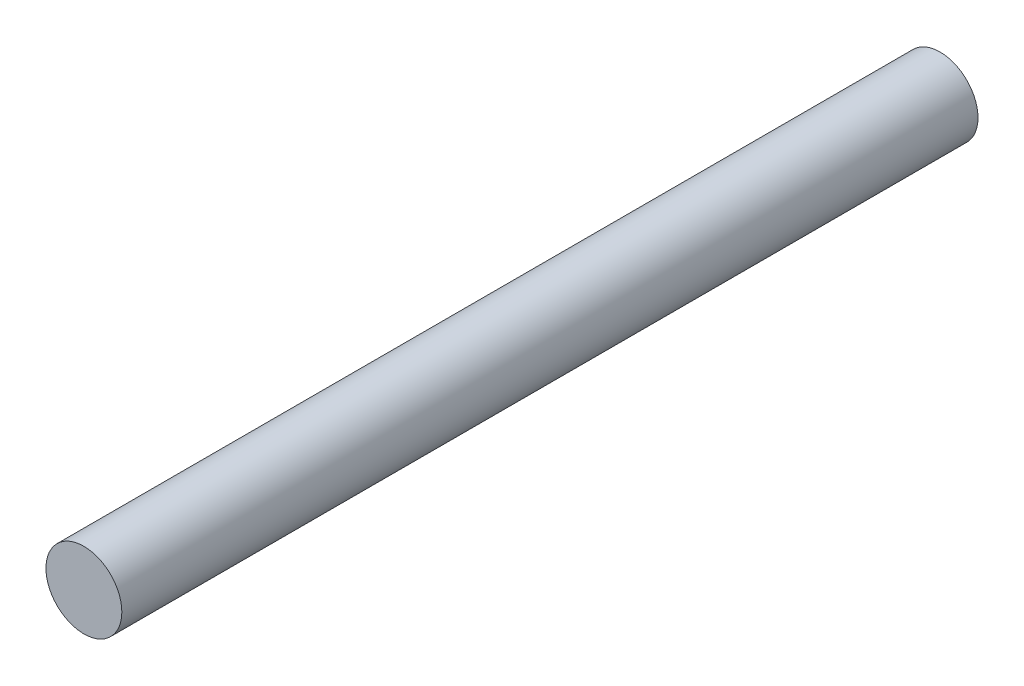
ISO-10303-21;
HEADER;
FILE_DESCRIPTION(('STEP AP214'),'2;1');
FILE_NAME('part.step','',(''),(''),'','','');
FILE_SCHEMA(('AUTOMOTIVE_DESIGN { 1 0 10303 214 1 1 1 1 }'));
ENDSEC;
DATA;
#1=APPLICATION_CONTEXT('core data for automotive mechanical design processes');
#2=APPLICATION_PROTOCOL_DEFINITION('international standard','automotive_design',2000,#1);
#3=PRODUCT_CONTEXT('',#1,'mechanical');
#4=PRODUCT('Part','Part','',(#3));
#5=PRODUCT_RELATED_PRODUCT_CATEGORY('part','',(#4));
#6=PRODUCT_DEFINITION_FORMATION('','',#4);
#7=PRODUCT_DEFINITION_CONTEXT('part definition',#1,'design');
#8=PRODUCT_DEFINITION('design','',#6,#7);
#9=PRODUCT_DEFINITION_SHAPE('','',#8);
#10=(LENGTH_UNIT() NAMED_UNIT(*) SI_UNIT(.MILLI.,.METRE.));
#11=(NAMED_UNIT(*) PLANE_ANGLE_UNIT() SI_UNIT($,.RADIAN.));
#12=(NAMED_UNIT(*) SI_UNIT($,.STERADIAN.) SOLID_ANGLE_UNIT());
#13=UNCERTAINTY_MEASURE_WITH_UNIT(LENGTH_MEASURE(1.E-05),#10,'distance_accuracy_value','');
#14=(GEOMETRIC_REPRESENTATION_CONTEXT(3) GLOBAL_UNCERTAINTY_ASSIGNED_CONTEXT((#13)) GLOBAL_UNIT_ASSIGNED_CONTEXT((#10,
#11,#12)) REPRESENTATION_CONTEXT('',''));
#15=CARTESIAN_POINT('',(0.,0.,0.));
#16=DIRECTION('',(0.,0.,1.));
#17=DIRECTION('',(1.,0.,0.));
#18=AXIS2_PLACEMENT_3D('',#15,#16,#17);
#19=CARTESIAN_POINT('',(156.32094950865,0.,-10.));
#20=DIRECTION('',(0.,0.,1.));
#21=DIRECTION('',(1.,0.,0.));
#22=AXIS2_PLACEMENT_3D('',#19,#20,#21);
#23=CYLINDRICAL_SURFACE('',#22,0.664999999999992);
#24=CARTESIAN_POINT('',(156.32094950865,0.,-10.));
#25=DIRECTION('',(0.,0.,1.));
#26=DIRECTION('',(1.,0.,0.));
#27=AXIS2_PLACEMENT_3D('',#24,#25,#26);
#28=CIRCLE('',#27,0.664999999999992);
#29=CARTESIAN_POINT('',(156.98594950865,0.,-10.));
#30=VERTEX_POINT('',#29);
#31=EDGE_CURVE('E10',#30,#30,#28,.T.);
#32=ORIENTED_EDGE('',*,*,#31,.T.);
#33=EDGE_LOOP('',(#32));
#34=FACE_BOUND('',#33,.T.);
#35=CARTESIAN_POINT('',(156.32094950865,0.,5.));
#36=DIRECTION('',(0.,0.,1.));
#37=DIRECTION('',(1.,0.,0.));
#38=AXIS2_PLACEMENT_3D('',#35,#36,#37);
#39=CIRCLE('',#38,0.664999999999992);
#40=CARTESIAN_POINT('',(156.98594950865,0.,5.));
#41=VERTEX_POINT('',#40);
#42=EDGE_CURVE('E37',#41,#41,#39,.T.);
#43=ORIENTED_EDGE('',*,*,#42,.F.);
#44=EDGE_LOOP('',(#43));
#45=FACE_BOUND('',#44,.T.);
#46=ADVANCED_FACE('F31',(#34,#45),#23,.T.);
#47=CARTESIAN_POINT('',(156.32094950865,0.,-10.));
#48=DIRECTION('',(0.,0.,1.));
#49=DIRECTION('',(1.,0.,0.));
#50=AXIS2_PLACEMENT_3D('',#47,#48,#49);
#51=PLANE('',#50);
#52=ORIENTED_EDGE('',*,*,#31,.F.);
#53=EDGE_LOOP('',(#52));
#54=FACE_BOUND('',#53,.T.);
#55=ADVANCED_FACE('F46',(#54),#51,.F.);
#56=CARTESIAN_POINT('',(156.32094950865,0.,5.));
#57=DIRECTION('',(0.,0.,1.));
#58=DIRECTION('',(1.,0.,0.));
#59=AXIS2_PLACEMENT_3D('',#56,#57,#58);
#60=PLANE('',#59);
#61=ORIENTED_EDGE('',*,*,#42,.T.);
#62=EDGE_LOOP('',(#61));
#63=FACE_BOUND('',#62,.T.);
#64=ADVANCED_FACE('F43',(#63),#60,.T.);
#65=CLOSED_SHELL('',(#46,#55,#64));
#66=MANIFOLD_SOLID_BREP('B2',#65);
#67=ADVANCED_BREP_SHAPE_REPRESENTATION('',(#18,#66),#14);
#68=SHAPE_DEFINITION_REPRESENTATION(#9,#67);
ENDSEC;
END-ISO-10303-21;
